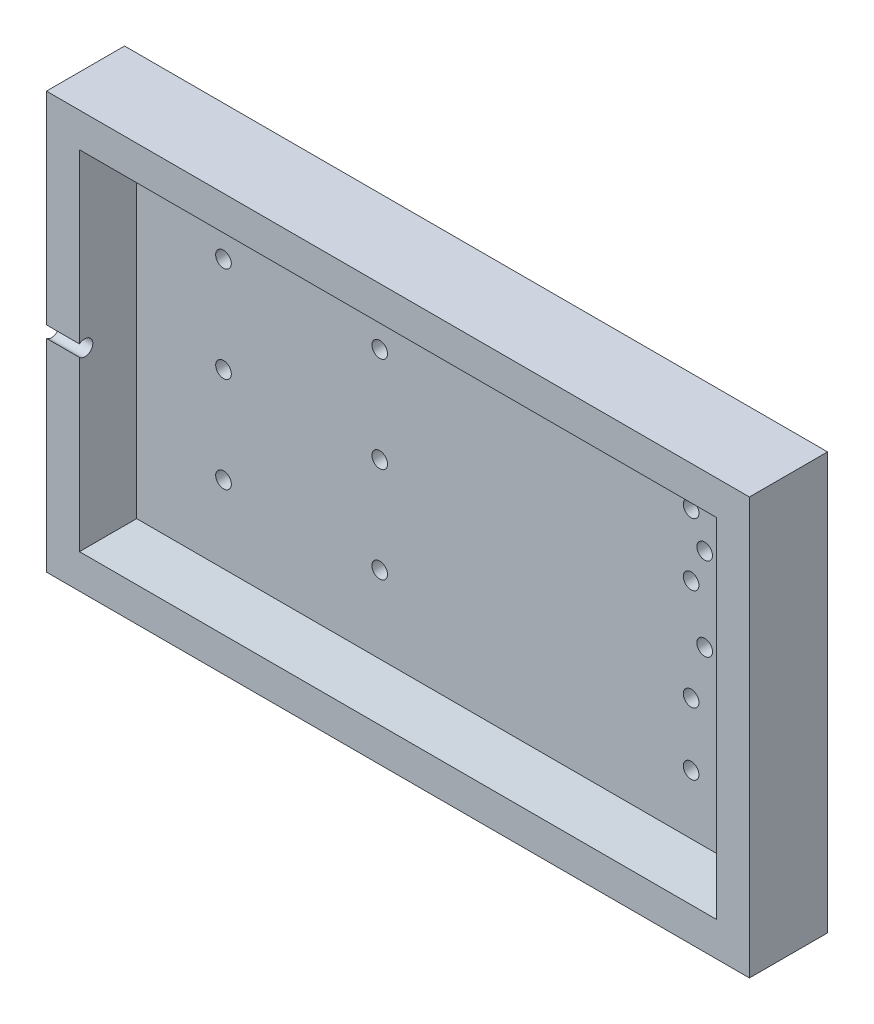
ISO-10303-21;
HEADER;
FILE_DESCRIPTION(('STEP AP214'),'2;1');
FILE_NAME('part.step','',(''),(''),'','','');
FILE_SCHEMA(('AUTOMOTIVE_DESIGN { 1 0 10303 214 1 1 1 1 }'));
ENDSEC;
DATA;
#1=APPLICATION_CONTEXT('core data for automotive mechanical design processes');
#2=APPLICATION_PROTOCOL_DEFINITION('international standard','automotive_design',2000,#1);
#3=PRODUCT_CONTEXT('',#1,'mechanical');
#4=PRODUCT('Part','Part','',(#3));
#5=PRODUCT_RELATED_PRODUCT_CATEGORY('part','',(#4));
#6=PRODUCT_DEFINITION_FORMATION('','',#4);
#7=PRODUCT_DEFINITION_CONTEXT('part definition',#1,'design');
#8=PRODUCT_DEFINITION('design','',#6,#7);
#9=PRODUCT_DEFINITION_SHAPE('','',#8);
#10=(LENGTH_UNIT() NAMED_UNIT(*) SI_UNIT(.MILLI.,.METRE.));
#11=(NAMED_UNIT(*) PLANE_ANGLE_UNIT() SI_UNIT($,.RADIAN.));
#12=(NAMED_UNIT(*) SI_UNIT($,.STERADIAN.) SOLID_ANGLE_UNIT());
#13=UNCERTAINTY_MEASURE_WITH_UNIT(LENGTH_MEASURE(1.E-05),#10,'distance_accuracy_value','');
#14=(GEOMETRIC_REPRESENTATION_CONTEXT(3) GLOBAL_UNCERTAINTY_ASSIGNED_CONTEXT((#13)) GLOBAL_UNIT_ASSIGNED_CONTEXT((#10,
#11,#12)) REPRESENTATION_CONTEXT('',''));
#15=CARTESIAN_POINT('',(0.,0.,0.));
#16=DIRECTION('',(0.,0.,1.));
#17=DIRECTION('',(1.,0.,0.));
#18=AXIS2_PLACEMENT_3D('',#15,#16,#17);
#19=CARTESIAN_POINT('',(53.3,40.,-30.));
#20=DIRECTION('',(0.,0.,-1.));
#21=DIRECTION('',(-1.,0.,0.));
#22=AXIS2_PLACEMENT_3D('',#19,#20,#21);
#23=CYLINDRICAL_SURFACE('',#22,1.5);
#24=CARTESIAN_POINT('',(53.3,40.,-40.));
#25=DIRECTION('',(0.,0.,-1.));
#26=DIRECTION('',(-1.,0.,0.));
#27=AXIS2_PLACEMENT_3D('',#24,#25,#26);
#28=CIRCLE('',#27,1.5);
#29=CARTESIAN_POINT('',(51.8,40.,-40.));
#30=VERTEX_POINT('',#29);
#31=EDGE_CURVE('E220',#30,#30,#28,.T.);
#32=ORIENTED_EDGE('',*,*,#31,.T.);
#33=EDGE_LOOP('',(#32));
#34=FACE_BOUND('',#33,.T.);
#35=CARTESIAN_POINT('',(53.3,40.,-35.7));
#36=DIRECTION('',(0.,0.,1.));
#37=DIRECTION('',(1.,0.,0.));
#38=AXIS2_PLACEMENT_3D('',#35,#36,#37);
#39=CIRCLE('',#38,1.5);
#40=CARTESIAN_POINT('',(54.8,40.,-35.7));
#41=VERTEX_POINT('',#40);
#42=EDGE_CURVE('E189',#41,#41,#39,.F.);
#43=ORIENTED_EDGE('',*,*,#42,.F.);
#44=EDGE_LOOP('',(#43));
#45=FACE_BOUND('',#44,.T.);
#46=ADVANCED_FACE('F35',(#34,#45),#23,.F.);
#47=CARTESIAN_POINT('',(113.1,49.75,-30.));
#48=DIRECTION('',(0.,0.,-1.));
#49=DIRECTION('',(-1.,0.,0.));
#50=AXIS2_PLACEMENT_3D('',#47,#48,#49);
#51=CYLINDRICAL_SURFACE('',#50,1.5);
#52=CARTESIAN_POINT('',(113.1,49.75,-40.));
#53=DIRECTION('',(0.,0.,-1.));
#54=DIRECTION('',(-1.,0.,0.));
#55=AXIS2_PLACEMENT_3D('',#52,#53,#54);
#56=CIRCLE('',#55,1.5);
#57=CARTESIAN_POINT('',(111.6,49.75,-40.));
#58=VERTEX_POINT('',#57);
#59=EDGE_CURVE('E199',#58,#58,#56,.T.);
#60=ORIENTED_EDGE('',*,*,#59,.T.);
#61=EDGE_LOOP('',(#60));
#62=FACE_BOUND('',#61,.T.);
#63=CARTESIAN_POINT('',(113.1,49.75,-35.7));
#64=DIRECTION('',(0.,0.,1.));
#65=DIRECTION('',(1.,0.,0.));
#66=AXIS2_PLACEMENT_3D('',#63,#64,#65);
#67=CIRCLE('',#66,1.5);
#68=CARTESIAN_POINT('',(114.6,49.75,-35.7));
#69=VERTEX_POINT('',#68);
#70=EDGE_CURVE('E186',#69,#69,#67,.F.);
#71=ORIENTED_EDGE('',*,*,#70,.F.);
#72=EDGE_LOOP('',(#71));
#73=FACE_BOUND('',#72,.T.);
#74=ADVANCED_FACE('F304',(#62,#73),#51,.F.);
#75=CARTESIAN_POINT('',(113.1,18.25,-30.));
#76=DIRECTION('',(0.,0.,-1.));
#77=DIRECTION('',(-1.,0.,0.));
#78=AXIS2_PLACEMENT_3D('',#75,#76,#77);
#79=CYLINDRICAL_SURFACE('',#78,1.5);
#80=CARTESIAN_POINT('',(113.1,18.25,-40.));
#81=DIRECTION('',(0.,0.,-1.));
#82=DIRECTION('',(-1.,0.,0.));
#83=AXIS2_PLACEMENT_3D('',#80,#81,#82);
#84=CIRCLE('',#83,1.5);
#85=CARTESIAN_POINT('',(111.6,18.25,-40.));
#86=VERTEX_POINT('',#85);
#87=EDGE_CURVE('E198',#86,#86,#84,.T.);
#88=ORIENTED_EDGE('',*,*,#87,.T.);
#89=EDGE_LOOP('',(#88));
#90=FACE_BOUND('',#89,.T.);
#91=CARTESIAN_POINT('',(113.1,18.25,-35.7));
#92=DIRECTION('',(0.,0.,1.));
#93=DIRECTION('',(1.,0.,0.));
#94=AXIS2_PLACEMENT_3D('',#91,#92,#93);
#95=CIRCLE('',#94,1.5);
#96=CARTESIAN_POINT('',(114.6,18.25,-35.7));
#97=VERTEX_POINT('',#96);
#98=EDGE_CURVE('E183',#97,#97,#95,.F.);
#99=ORIENTED_EDGE('',*,*,#98,.F.);
#100=EDGE_LOOP('',(#99));
#101=FACE_BOUND('',#100,.T.);
#102=ADVANCED_FACE('F310',(#90,#101),#79,.F.);
#103=CARTESIAN_POINT('',(113.1,30.25,-30.));
#104=DIRECTION('',(0.,0.,-1.));
#105=DIRECTION('',(-1.,0.,0.));
#106=AXIS2_PLACEMENT_3D('',#103,#104,#105);
#107=CYLINDRICAL_SURFACE('',#106,1.5);
#108=CARTESIAN_POINT('',(113.1,30.25,-40.));
#109=DIRECTION('',(0.,0.,-1.));
#110=DIRECTION('',(-1.,0.,0.));
#111=AXIS2_PLACEMENT_3D('',#108,#109,#110);
#112=CIRCLE('',#111,1.5);
#113=CARTESIAN_POINT('',(111.6,30.25,-40.));
#114=VERTEX_POINT('',#113);
#115=EDGE_CURVE('E195',#114,#114,#112,.T.);
#116=ORIENTED_EDGE('',*,*,#115,.T.);
#117=EDGE_LOOP('',(#116));
#118=FACE_BOUND('',#117,.T.);
#119=CARTESIAN_POINT('',(113.1,30.25,-35.7));
#120=DIRECTION('',(0.,0.,1.));
#121=DIRECTION('',(1.,0.,0.));
#122=AXIS2_PLACEMENT_3D('',#119,#120,#121);
#123=CIRCLE('',#122,1.5);
#124=CARTESIAN_POINT('',(114.6,30.25,-35.7));
#125=VERTEX_POINT('',#124);
#126=EDGE_CURVE('E180',#125,#125,#123,.F.);
#127=ORIENTED_EDGE('',*,*,#126,.F.);
#128=EDGE_LOOP('',(#127));
#129=FACE_BOUND('',#128,.T.);
#130=ADVANCED_FACE('F421',(#118,#129),#107,.F.);
#131=CARTESIAN_POINT('',(53.3,58.35,-30.));
#132=DIRECTION('',(0.,0.,-1.));
#133=DIRECTION('',(-1.,0.,0.));
#134=AXIS2_PLACEMENT_3D('',#131,#132,#133);
#135=CYLINDRICAL_SURFACE('',#134,1.5);
#136=CARTESIAN_POINT('',(53.3,58.35,-40.));
#137=DIRECTION('',(0.,0.,-1.));
#138=DIRECTION('',(-1.,0.,0.));
#139=AXIS2_PLACEMENT_3D('',#136,#137,#138);
#140=CIRCLE('',#139,1.5);
#141=CARTESIAN_POINT('',(51.8,58.35,-40.));
#142=VERTEX_POINT('',#141);
#143=EDGE_CURVE('E217',#142,#142,#140,.T.);
#144=ORIENTED_EDGE('',*,*,#143,.T.);
#145=EDGE_LOOP('',(#144));
#146=FACE_BOUND('',#145,.T.);
#147=CARTESIAN_POINT('',(53.3,58.35,-35.7));
#148=DIRECTION('',(0.,0.,1.));
#149=DIRECTION('',(1.,0.,0.));
#150=AXIS2_PLACEMENT_3D('',#147,#148,#149);
#151=CIRCLE('',#150,1.5);
#152=CARTESIAN_POINT('',(54.8,58.35,-35.7));
#153=VERTEX_POINT('',#152);
#154=EDGE_CURVE('E177',#153,#153,#151,.F.);
#155=ORIENTED_EDGE('',*,*,#154,.F.);
#156=EDGE_LOOP('',(#155));
#157=FACE_BOUND('',#156,.T.);
#158=ADVANCED_FACE('F411',(#146,#157),#135,.F.);
#159=CARTESIAN_POINT('',(53.3,21.65,-30.));
#160=DIRECTION('',(0.,0.,-1.));
#161=DIRECTION('',(-1.,0.,0.));
#162=AXIS2_PLACEMENT_3D('',#159,#160,#161);
#163=CYLINDRICAL_SURFACE('',#162,1.5);
#164=CARTESIAN_POINT('',(53.3,21.65,-40.));
#165=DIRECTION('',(0.,0.,-1.));
#166=DIRECTION('',(-1.,0.,0.));
#167=AXIS2_PLACEMENT_3D('',#164,#165,#166);
#168=CIRCLE('',#167,1.5);
#169=CARTESIAN_POINT('',(51.8,21.65,-40.));
#170=VERTEX_POINT('',#169);
#171=EDGE_CURVE('E221',#170,#170,#168,.T.);
#172=ORIENTED_EDGE('',*,*,#171,.T.);
#173=EDGE_LOOP('',(#172));
#174=FACE_BOUND('',#173,.T.);
#175=CARTESIAN_POINT('',(53.3,21.65,-35.7));
#176=DIRECTION('',(0.,0.,1.));
#177=DIRECTION('',(1.,0.,0.));
#178=AXIS2_PLACEMENT_3D('',#175,#176,#177);
#179=CIRCLE('',#178,1.5);
#180=CARTESIAN_POINT('',(54.8,21.65,-35.7));
#181=VERTEX_POINT('',#180);
#182=EDGE_CURVE('E174',#181,#181,#179,.F.);
#183=ORIENTED_EDGE('',*,*,#182,.F.);
#184=EDGE_LOOP('',(#183));
#185=FACE_BOUND('',#184,.T.);
#186=ADVANCED_FACE('F402',(#174,#185),#163,.F.);
#187=CARTESIAN_POINT('',(23.3,58.35,-30.));
#188=DIRECTION('',(0.,0.,-1.));
#189=DIRECTION('',(-1.,0.,0.));
#190=AXIS2_PLACEMENT_3D('',#187,#188,#189);
#191=CYLINDRICAL_SURFACE('',#190,1.5);
#192=CARTESIAN_POINT('',(23.3,58.35,-40.));
#193=DIRECTION('',(0.,0.,-1.));
#194=DIRECTION('',(-1.,0.,0.));
#195=AXIS2_PLACEMENT_3D('',#192,#193,#194);
#196=CIRCLE('',#195,1.5);
#197=CARTESIAN_POINT('',(21.8,58.35,-40.));
#198=VERTEX_POINT('',#197);
#199=EDGE_CURVE('E224',#198,#198,#196,.T.);
#200=ORIENTED_EDGE('',*,*,#199,.T.);
#201=EDGE_LOOP('',(#200));
#202=FACE_BOUND('',#201,.T.);
#203=CARTESIAN_POINT('',(23.3,58.35,-35.7));
#204=DIRECTION('',(0.,0.,1.));
#205=DIRECTION('',(1.,0.,0.));
#206=AXIS2_PLACEMENT_3D('',#203,#204,#205);
#207=CIRCLE('',#206,1.5);
#208=CARTESIAN_POINT('',(24.8,58.35,-35.7));
#209=VERTEX_POINT('',#208);
#210=EDGE_CURVE('E171',#209,#209,#207,.F.);
#211=ORIENTED_EDGE('',*,*,#210,.F.);
#212=EDGE_LOOP('',(#211));
#213=FACE_BOUND('',#212,.T.);
#214=ADVANCED_FACE('F393',(#202,#213),#191,.F.);
#215=CARTESIAN_POINT('',(23.3,40.,-30.));
#216=DIRECTION('',(0.,0.,-1.));
#217=DIRECTION('',(-1.,0.,0.));
#218=AXIS2_PLACEMENT_3D('',#215,#216,#217);
#219=CYLINDRICAL_SURFACE('',#218,1.5);
#220=CARTESIAN_POINT('',(23.3,40.,-40.));
#221=DIRECTION('',(0.,0.,-1.));
#222=DIRECTION('',(-1.,0.,0.));
#223=AXIS2_PLACEMENT_3D('',#220,#221,#222);
#224=CIRCLE('',#223,1.5);
#225=CARTESIAN_POINT('',(21.8,40.,-40.));
#226=VERTEX_POINT('',#225);
#227=EDGE_CURVE('E208',#226,#226,#224,.T.);
#228=ORIENTED_EDGE('',*,*,#227,.T.);
#229=EDGE_LOOP('',(#228));
#230=FACE_BOUND('',#229,.T.);
#231=CARTESIAN_POINT('',(23.3,40.,-35.7));
#232=DIRECTION('',(0.,0.,1.));
#233=DIRECTION('',(1.,0.,0.));
#234=AXIS2_PLACEMENT_3D('',#231,#232,#233);
#235=CIRCLE('',#234,1.5);
#236=CARTESIAN_POINT('',(24.8,40.,-35.7));
#237=VERTEX_POINT('',#236);
#238=EDGE_CURVE('E168',#237,#237,#235,.F.);
#239=ORIENTED_EDGE('',*,*,#238,.F.);
#240=EDGE_LOOP('',(#239));
#241=FACE_BOUND('',#240,.T.);
#242=ADVANCED_FACE('F315',(#230,#241),#219,.F.);
#243=CARTESIAN_POINT('',(23.3,21.65,-30.));
#244=DIRECTION('',(0.,0.,-1.));
#245=DIRECTION('',(-1.,0.,0.));
#246=AXIS2_PLACEMENT_3D('',#243,#244,#245);
#247=CYLINDRICAL_SURFACE('',#246,1.5);
#248=CARTESIAN_POINT('',(23.3,21.65,-40.));
#249=DIRECTION('',(0.,0.,-1.));
#250=DIRECTION('',(-1.,0.,0.));
#251=AXIS2_PLACEMENT_3D('',#248,#249,#250);
#252=CIRCLE('',#251,1.5);
#253=CARTESIAN_POINT('',(21.8,21.65,-40.));
#254=VERTEX_POINT('',#253);
#255=EDGE_CURVE('E205',#254,#254,#252,.T.);
#256=ORIENTED_EDGE('',*,*,#255,.T.);
#257=EDGE_LOOP('',(#256));
#258=FACE_BOUND('',#257,.T.);
#259=CARTESIAN_POINT('',(23.3,21.65,-35.7));
#260=DIRECTION('',(0.,0.,1.));
#261=DIRECTION('',(1.,0.,0.));
#262=AXIS2_PLACEMENT_3D('',#259,#260,#261);
#263=CIRCLE('',#262,1.5);
#264=CARTESIAN_POINT('',(24.8,21.65,-35.7));
#265=VERTEX_POINT('',#264);
#266=EDGE_CURVE('E165',#265,#265,#263,.F.);
#267=ORIENTED_EDGE('',*,*,#266,.F.);
#268=EDGE_LOOP('',(#267));
#269=FACE_BOUND('',#268,.T.);
#270=ADVANCED_FACE('F374',(#258,#269),#247,.F.);
#271=CARTESIAN_POINT('',(115.7,40.,-30.));
#272=DIRECTION('',(0.,0.,-1.));
#273=DIRECTION('',(-1.,0.,0.));
#274=AXIS2_PLACEMENT_3D('',#271,#272,#273);
#275=CYLINDRICAL_SURFACE('',#274,1.5);
#276=CARTESIAN_POINT('',(115.7,40.,-40.));
#277=DIRECTION('',(0.,0.,-1.));
#278=DIRECTION('',(-1.,0.,0.));
#279=AXIS2_PLACEMENT_3D('',#276,#277,#278);
#280=CIRCLE('',#279,1.5);
#281=CARTESIAN_POINT('',(114.2,40.,-40.));
#282=VERTEX_POINT('',#281);
#283=EDGE_CURVE('E209',#282,#282,#280,.T.);
#284=ORIENTED_EDGE('',*,*,#283,.T.);
#285=EDGE_LOOP('',(#284));
#286=FACE_BOUND('',#285,.T.);
#287=CARTESIAN_POINT('',(115.7,40.,-35.7));
#288=DIRECTION('',(0.,0.,1.));
#289=DIRECTION('',(1.,0.,0.));
#290=AXIS2_PLACEMENT_3D('',#287,#288,#289);
#291=CIRCLE('',#290,1.5);
#292=CARTESIAN_POINT('',(117.2,40.,-35.7));
#293=VERTEX_POINT('',#292);
#294=EDGE_CURVE('E147',#293,#293,#291,.F.);
#295=ORIENTED_EDGE('',*,*,#294,.F.);
#296=EDGE_LOOP('',(#295));
#297=FACE_BOUND('',#296,.T.);
#298=ADVANCED_FACE('F364',(#286,#297),#275,.F.);
#299=CARTESIAN_POINT('',(115.7,56.,-30.));
#300=DIRECTION('',(0.,0.,-1.));
#301=DIRECTION('',(-1.,0.,0.));
#302=AXIS2_PLACEMENT_3D('',#299,#300,#301);
#303=CYLINDRICAL_SURFACE('',#302,1.5);
#304=CARTESIAN_POINT('',(115.7,56.,-40.));
#305=DIRECTION('',(0.,0.,-1.));
#306=DIRECTION('',(-1.,0.,0.));
#307=AXIS2_PLACEMENT_3D('',#304,#305,#306);
#308=CIRCLE('',#307,1.5);
#309=CARTESIAN_POINT('',(114.2,56.,-40.));
#310=VERTEX_POINT('',#309);
#311=EDGE_CURVE('E212',#310,#310,#308,.T.);
#312=ORIENTED_EDGE('',*,*,#311,.T.);
#313=EDGE_LOOP('',(#312));
#314=FACE_BOUND('',#313,.T.);
#315=CARTESIAN_POINT('',(115.7,56.,-35.7));
#316=DIRECTION('',(0.,0.,1.));
#317=DIRECTION('',(1.,0.,0.));
#318=AXIS2_PLACEMENT_3D('',#315,#316,#317);
#319=CIRCLE('',#318,1.5);
#320=CARTESIAN_POINT('',(117.2,56.,-35.7));
#321=VERTEX_POINT('',#320);
#322=EDGE_CURVE('E142',#321,#321,#319,.F.);
#323=ORIENTED_EDGE('',*,*,#322,.F.);
#324=EDGE_LOOP('',(#323));
#325=FACE_BOUND('',#324,.T.);
#326=ADVANCED_FACE('F353',(#314,#325),#303,.F.);
#327=CARTESIAN_POINT('',(113.1,61.75,-30.));
#328=DIRECTION('',(0.,0.,-1.));
#329=DIRECTION('',(-1.,0.,0.));
#330=AXIS2_PLACEMENT_3D('',#327,#328,#329);
#331=CYLINDRICAL_SURFACE('',#330,1.5);
#332=CARTESIAN_POINT('',(113.1,61.75,-40.));
#333=DIRECTION('',(0.,0.,-1.));
#334=DIRECTION('',(-1.,0.,0.));
#335=AXIS2_PLACEMENT_3D('',#332,#333,#334);
#336=CIRCLE('',#335,1.5);
#337=CARTESIAN_POINT('',(111.6,61.75,-40.));
#338=VERTEX_POINT('',#337);
#339=EDGE_CURVE('E202',#338,#338,#336,.T.);
#340=ORIENTED_EDGE('',*,*,#339,.T.);
#341=EDGE_LOOP('',(#340));
#342=FACE_BOUND('',#341,.T.);
#343=CARTESIAN_POINT('',(113.1,61.75,-35.7));
#344=DIRECTION('',(0.,0.,1.));
#345=DIRECTION('',(1.,0.,0.));
#346=AXIS2_PLACEMENT_3D('',#343,#344,#345);
#347=CIRCLE('',#346,1.5);
#348=CARTESIAN_POINT('',(114.6,61.75,-35.7));
#349=VERTEX_POINT('',#348);
#350=EDGE_CURVE('E140',#349,#349,#347,.F.);
#351=ORIENTED_EDGE('',*,*,#350,.F.);
#352=EDGE_LOOP('',(#351));
#353=FACE_BOUND('',#352,.T.);
#354=ADVANCED_FACE('F337',(#342,#353),#331,.F.);
#355=CARTESIAN_POINT('',(0.,0.,-40.));
#356=DIRECTION('',(-1.,0.,0.));
#357=DIRECTION('',(0.,0.,1.));
#358=AXIS2_PLACEMENT_3D('',#355,#356,#357);
#359=PLANE('',#358);
#360=DIRECTION('',(0.,1.,0.));
#361=VECTOR('',#360,1.);
#362=CARTESIAN_POINT('',(0.,-20.,-25.));
#363=LINE('',#362,#361);
#364=CARTESIAN_POINT('',(0.,41.1180339887499,-25.));
#365=VERTEX_POINT('',#364);
#366=CARTESIAN_POINT('',(0.,80.,-25.));
#367=VERTEX_POINT('',#366);
#368=EDGE_CURVE('E119',#365,#367,#363,.T.);
#369=ORIENTED_EDGE('',*,*,#368,.T.);
#370=DIRECTION('',(0.,0.,1.));
#371=VECTOR('',#370,1.);
#372=CARTESIAN_POINT('',(0.,80.,-40.));
#373=LINE('',#372,#371);
#374=CARTESIAN_POINT('',(0.,80.,-40.));
#375=VERTEX_POINT('',#374);
#376=EDGE_CURVE('E43',#375,#367,#373,.T.);
#377=ORIENTED_EDGE('',*,*,#376,.F.);
#378=DIRECTION('',(0.,-1.,0.));
#379=VECTOR('',#378,1.);
#380=CARTESIAN_POINT('',(0.,0.,-40.));
#381=LINE('',#380,#379);
#382=CARTESIAN_POINT('',(0.,0.,-40.));
#383=VERTEX_POINT('',#382);
#384=EDGE_CURVE('E231',#375,#383,#381,.T.);
#385=ORIENTED_EDGE('',*,*,#384,.T.);
#386=DIRECTION('',(0.,0.,1.));
#387=VECTOR('',#386,1.);
#388=CARTESIAN_POINT('',(0.,0.,-40.));
#389=LINE('',#388,#387);
#390=CARTESIAN_POINT('',(0.,0.,-25.));
#391=VERTEX_POINT('',#390);
#392=EDGE_CURVE('E134',#383,#391,#389,.T.);
#393=ORIENTED_EDGE('',*,*,#392,.T.);
#394=CARTESIAN_POINT('',(0.,38.8819660112501,-25.));
#395=VERTEX_POINT('',#394);
#396=EDGE_CURVE('E241',#391,#395,#363,.T.);
#397=ORIENTED_EDGE('',*,*,#396,.T.);
#398=CARTESIAN_POINT('',(0.,40.,-26.));
#399=DIRECTION('',(-1.,0.,0.));
#400=DIRECTION('',(0.,0.,1.));
#401=AXIS2_PLACEMENT_3D('',#398,#399,#400);
#402=CIRCLE('',#401,1.5);
#403=EDGE_CURVE('E192',#365,#395,#402,.T.);
#404=ORIENTED_EDGE('',*,*,#403,.F.);
#405=EDGE_LOOP('',(#369,#377,#385,#393,#397,#404));
#406=FACE_BOUND('',#405,.T.);
#407=ADVANCED_FACE('F37',(#406),#359,.T.);
#408=CARTESIAN_POINT('',(0.,80.,-40.));
#409=DIRECTION('',(0.,1.,0.));
#410=DIRECTION('',(0.,0.,1.));
#411=AXIS2_PLACEMENT_3D('',#408,#409,#410);
#412=PLANE('',#411);
#413=DIRECTION('',(-1.,0.,0.));
#414=VECTOR('',#413,1.);
#415=CARTESIAN_POINT('',(0.,80.,-25.));
#416=LINE('',#415,#414);
#417=CARTESIAN_POINT('',(135.,80.,-25.));
#418=VERTEX_POINT('',#417);
#419=EDGE_CURVE('E113',#418,#367,#416,.T.);
#420=ORIENTED_EDGE('',*,*,#419,.F.);
#421=DIRECTION('',(0.,0.,1.));
#422=VECTOR('',#421,1.);
#423=CARTESIAN_POINT('',(135.,80.,-40.));
#424=LINE('',#423,#422);
#425=CARTESIAN_POINT('',(135.,80.,-40.));
#426=VERTEX_POINT('',#425);
#427=EDGE_CURVE('E124',#426,#418,#424,.T.);
#428=ORIENTED_EDGE('',*,*,#427,.F.);
#429=DIRECTION('',(-1.,0.,0.));
#430=VECTOR('',#429,1.);
#431=CARTESIAN_POINT('',(0.,80.,-40.));
#432=LINE('',#431,#430);
#433=EDGE_CURVE('E139',#426,#375,#432,.T.);
#434=ORIENTED_EDGE('',*,*,#433,.T.);
#435=ORIENTED_EDGE('',*,*,#376,.T.);
#436=EDGE_LOOP('',(#420,#428,#434,#435));
#437=FACE_BOUND('',#436,.T.);
#438=ADVANCED_FACE('F122',(#437),#412,.T.);
#439=CARTESIAN_POINT('',(135.,0.,-40.));
#440=DIRECTION('',(1.,0.,0.));
#441=DIRECTION('',(0.,0.,-1.));
#442=AXIS2_PLACEMENT_3D('',#439,#440,#441);
#443=PLANE('',#442);
#444=DIRECTION('',(0.,1.,0.));
#445=VECTOR('',#444,1.);
#446=CARTESIAN_POINT('',(135.,-20.,-25.));
#447=LINE('',#446,#445);
#448=CARTESIAN_POINT('',(135.,0.,-25.));
#449=VERTEX_POINT('',#448);
#450=EDGE_CURVE('E110',#449,#418,#447,.T.);
#451=ORIENTED_EDGE('',*,*,#450,.F.);
#452=DIRECTION('',(0.,0.,1.));
#453=VECTOR('',#452,1.);
#454=CARTESIAN_POINT('',(135.,0.,-40.));
#455=LINE('',#454,#453);
#456=CARTESIAN_POINT('',(135.,0.,-40.));
#457=VERTEX_POINT('',#456);
#458=EDGE_CURVE('E131',#457,#449,#455,.T.);
#459=ORIENTED_EDGE('',*,*,#458,.F.);
#460=DIRECTION('',(0.,1.,0.));
#461=VECTOR('',#460,1.);
#462=CARTESIAN_POINT('',(135.,0.,-40.));
#463=LINE('',#462,#461);
#464=EDGE_CURVE('E129',#457,#426,#463,.T.);
#465=ORIENTED_EDGE('',*,*,#464,.T.);
#466=ORIENTED_EDGE('',*,*,#427,.T.);
#467=EDGE_LOOP('',(#451,#459,#465,#466));
#468=FACE_BOUND('',#467,.T.);
#469=ADVANCED_FACE('F127',(#468),#443,.T.);
#470=CARTESIAN_POINT('',(0.,0.,-40.));
#471=DIRECTION('',(0.,-1.,0.));
#472=DIRECTION('',(0.,0.,-1.));
#473=AXIS2_PLACEMENT_3D('',#470,#471,#472);
#474=PLANE('',#473);
#475=DIRECTION('',(1.,0.,0.));
#476=VECTOR('',#475,1.);
#477=CARTESIAN_POINT('',(0.,0.,-25.));
#478=LINE('',#477,#476);
#479=EDGE_CURVE('E115',#391,#449,#478,.T.);
#480=ORIENTED_EDGE('',*,*,#479,.F.);
#481=ORIENTED_EDGE('',*,*,#392,.F.);
#482=DIRECTION('',(1.,0.,0.));
#483=VECTOR('',#482,1.);
#484=CARTESIAN_POINT('',(0.,0.,-40.));
#485=LINE('',#484,#483);
#486=EDGE_CURVE('E233',#383,#457,#485,.T.);
#487=ORIENTED_EDGE('',*,*,#486,.T.);
#488=ORIENTED_EDGE('',*,*,#458,.T.);
#489=EDGE_LOOP('',(#480,#481,#487,#488));
#490=FACE_BOUND('',#489,.T.);
#491=ADVANCED_FACE('F243',(#490),#474,.T.);
#492=CARTESIAN_POINT('',(0.,0.,-40.));
#493=DIRECTION('',(0.,0.,-1.));
#494=DIRECTION('',(-1.,0.,0.));
#495=AXIS2_PLACEMENT_3D('',#492,#493,#494);
#496=PLANE('',#495);
#497=ORIENTED_EDGE('',*,*,#339,.F.);
#498=EDGE_LOOP('',(#497));
#499=FACE_BOUND('',#498,.T.);
#500=ORIENTED_EDGE('',*,*,#311,.F.);
#501=EDGE_LOOP('',(#500));
#502=FACE_BOUND('',#501,.T.);
#503=ORIENTED_EDGE('',*,*,#283,.F.);
#504=EDGE_LOOP('',(#503));
#505=FACE_BOUND('',#504,.T.);
#506=ORIENTED_EDGE('',*,*,#255,.F.);
#507=EDGE_LOOP('',(#506));
#508=FACE_BOUND('',#507,.T.);
#509=ORIENTED_EDGE('',*,*,#227,.F.);
#510=EDGE_LOOP('',(#509));
#511=FACE_BOUND('',#510,.T.);
#512=ORIENTED_EDGE('',*,*,#199,.F.);
#513=EDGE_LOOP('',(#512));
#514=FACE_BOUND('',#513,.T.);
#515=ORIENTED_EDGE('',*,*,#171,.F.);
#516=EDGE_LOOP('',(#515));
#517=FACE_BOUND('',#516,.T.);
#518=ORIENTED_EDGE('',*,*,#143,.F.);
#519=EDGE_LOOP('',(#518));
#520=FACE_BOUND('',#519,.T.);
#521=ORIENTED_EDGE('',*,*,#115,.F.);
#522=EDGE_LOOP('',(#521));
#523=FACE_BOUND('',#522,.T.);
#524=ORIENTED_EDGE('',*,*,#87,.F.);
#525=EDGE_LOOP('',(#524));
#526=FACE_BOUND('',#525,.T.);
#527=ORIENTED_EDGE('',*,*,#59,.F.);
#528=EDGE_LOOP('',(#527));
#529=FACE_BOUND('',#528,.T.);
#530=ORIENTED_EDGE('',*,*,#31,.F.);
#531=EDGE_LOOP('',(#530));
#532=FACE_BOUND('',#531,.T.);
#533=ORIENTED_EDGE('',*,*,#384,.F.);
#534=ORIENTED_EDGE('',*,*,#433,.F.);
#535=ORIENTED_EDGE('',*,*,#464,.F.);
#536=ORIENTED_EDGE('',*,*,#486,.F.);
#537=EDGE_LOOP('',(#533,#534,#535,#536));
#538=FACE_BOUND('',#537,.T.);
#539=ADVANCED_FACE('F237',(#499,#502,#505,#508,#511,#514,#517,#520,#523,#526,#529,#532,#538),
#496,.T.);
#540=CARTESIAN_POINT('',(10.,40.,-26.));
#541=DIRECTION('',(-1.,0.,0.));
#542=DIRECTION('',(0.,0.,1.));
#543=AXIS2_PLACEMENT_3D('',#540,#541,#542);
#544=CYLINDRICAL_SURFACE('',#543,1.5);
#545=ORIENTED_EDGE('',*,*,#403,.T.);
#546=DIRECTION('',(-1.,0.,0.));
#547=VECTOR('',#546,1.);
#548=CARTESIAN_POINT('',(10.,38.8819660112501,-25.));
#549=LINE('',#548,#547);
#550=CARTESIAN_POINT('',(6.34264803922962,38.8819660112501,-25.));
#551=VERTEX_POINT('',#550);
#552=EDGE_CURVE('E245',#395,#551,#549,.F.);
#553=ORIENTED_EDGE('',*,*,#552,.T.);
#554=CARTESIAN_POINT('',(6.3688339607988,40.,-26.));
#555=DIRECTION('',(-0.999657324975557,0.,-0.0261769483078695));
#556=DIRECTION('',(-0.0261769483078695,0.,0.999657324975557));
#557=AXIS2_PLACEMENT_3D('',#554,#555,#556);
#558=ELLIPSE('',#557,1.5005141887363,1.5);
#559=CARTESIAN_POINT('',(6.34264803922962,41.1180339887499,-25.));
#560=VERTEX_POINT('',#559);
#561=EDGE_CURVE('E143',#551,#560,#558,.F.);
#562=ORIENTED_EDGE('',*,*,#561,.T.);
#563=DIRECTION('',(-1.,0.,0.));
#564=VECTOR('',#563,1.);
#565=CARTESIAN_POINT('',(10.,41.1180339887499,-25.));
#566=LINE('',#565,#564);
#567=EDGE_CURVE('E286',#560,#365,#566,.T.);
#568=ORIENTED_EDGE('',*,*,#567,.T.);
#569=EDGE_LOOP('',(#545,#553,#562,#568));
#570=FACE_BOUND('',#569,.T.);
#571=ADVANCED_FACE('F290',(#570),#544,.F.);
#572=CARTESIAN_POINT('',(67.5,40.,-35.7));
#573=DIRECTION('',(0.,0.,1.));
#574=DIRECTION('',(1.,0.,0.));
#575=AXIS2_PLACEMENT_3D('',#572,#573,#574);
#576=PLANE('',#575);
#577=DIRECTION('',(0.,1.,0.));
#578=VECTOR('',#577,1.);
#579=CARTESIAN_POINT('',(128.37716259998,40.,-35.7));
#580=LINE('',#579,#578);
#581=CARTESIAN_POINT('',(128.37716259998,6.85816993629444,-35.7));
#582=VERTEX_POINT('',#581);
#583=CARTESIAN_POINT('',(128.37716259998,73.1418300637055,-35.7));
#584=VERTEX_POINT('',#583);
#585=EDGE_CURVE('E244',#582,#584,#580,.T.);
#586=ORIENTED_EDGE('',*,*,#585,.T.);
#587=DIRECTION('',(-1.,0.,0.));
#588=VECTOR('',#587,1.);
#589=CARTESIAN_POINT('',(67.5,73.1418300637055,-35.7));
#590=LINE('',#589,#588);
#591=CARTESIAN_POINT('',(6.62283740001987,73.1418300637055,-35.7));
#592=VERTEX_POINT('',#591);
#593=EDGE_CURVE('E160',#584,#592,#590,.T.);
#594=ORIENTED_EDGE('',*,*,#593,.T.);
#595=DIRECTION('',(0.,-1.,0.));
#596=VECTOR('',#595,1.);
#597=CARTESIAN_POINT('',(6.62283740001988,40.,-35.7));
#598=LINE('',#597,#596);
#599=CARTESIAN_POINT('',(6.62283740001988,6.85816993629444,-35.7));
#600=VERTEX_POINT('',#599);
#601=EDGE_CURVE('E262',#592,#600,#598,.T.);
#602=ORIENTED_EDGE('',*,*,#601,.T.);
#603=DIRECTION('',(1.,0.,0.));
#604=VECTOR('',#603,1.);
#605=CARTESIAN_POINT('',(67.5,6.85816993629444,-35.7));
#606=LINE('',#605,#604);
#607=EDGE_CURVE('E257',#600,#582,#606,.T.);
#608=ORIENTED_EDGE('',*,*,#607,.T.);
#609=EDGE_LOOP('',(#586,#594,#602,#608));
#610=FACE_BOUND('',#609,.T.);
#611=ORIENTED_EDGE('',*,*,#350,.T.);
#612=EDGE_LOOP('',(#611));
#613=FACE_BOUND('',#612,.T.);
#614=ORIENTED_EDGE('',*,*,#322,.T.);
#615=EDGE_LOOP('',(#614));
#616=FACE_BOUND('',#615,.T.);
#617=ORIENTED_EDGE('',*,*,#294,.T.);
#618=EDGE_LOOP('',(#617));
#619=FACE_BOUND('',#618,.T.);
#620=ORIENTED_EDGE('',*,*,#266,.T.);
#621=EDGE_LOOP('',(#620));
#622=FACE_BOUND('',#621,.T.);
#623=ORIENTED_EDGE('',*,*,#238,.T.);
#624=EDGE_LOOP('',(#623));
#625=FACE_BOUND('',#624,.T.);
#626=ORIENTED_EDGE('',*,*,#210,.T.);
#627=EDGE_LOOP('',(#626));
#628=FACE_BOUND('',#627,.T.);
#629=ORIENTED_EDGE('',*,*,#182,.T.);
#630=EDGE_LOOP('',(#629));
#631=FACE_BOUND('',#630,.T.);
#632=ORIENTED_EDGE('',*,*,#154,.T.);
#633=EDGE_LOOP('',(#632));
#634=FACE_BOUND('',#633,.T.);
#635=ORIENTED_EDGE('',*,*,#126,.T.);
#636=EDGE_LOOP('',(#635));
#637=FACE_BOUND('',#636,.T.);
#638=ORIENTED_EDGE('',*,*,#98,.T.);
#639=EDGE_LOOP('',(#638));
#640=FACE_BOUND('',#639,.T.);
#641=ORIENTED_EDGE('',*,*,#70,.T.);
#642=EDGE_LOOP('',(#641));
#643=FACE_BOUND('',#642,.T.);
#644=ORIENTED_EDGE('',*,*,#42,.T.);
#645=EDGE_LOOP('',(#644));
#646=FACE_BOUND('',#645,.T.);
#647=ADVANCED_FACE('F270',(#610,#613,#616,#619,#622,#625,#628,#631,#634,#637,#640,#643,#646),
#576,.T.);
#648=CARTESIAN_POINT('',(5.68800000000003,74.08125,0.));
#649=DIRECTION('',(-0.999657324975557,0.,-0.0261769483078695));
#650=DIRECTION('',(-0.0261769483078695,0.,0.999657324975557));
#651=AXIS2_PLACEMENT_3D('',#648,#649,#650);
#652=PLANE('',#651);
#653=DIRECTION('',(-0.0261678962124951,0.0262961702135367,0.999311639399798));
#654=VECTOR('',#653,1.);
#655=CARTESIAN_POINT('',(5.77265319062246,73.9961818427569,-3.23277492444828));
#656=LINE('',#655,#654);
#657=CARTESIAN_POINT('',(6.34264803922961,73.4233929017546,-25.));
#658=VERTEX_POINT('',#657);
#659=EDGE_CURVE('E256',#592,#658,#656,.T.);
#660=ORIENTED_EDGE('',*,*,#659,.T.);
#661=DIRECTION('',(0.,-1.,0.));
#662=VECTOR('',#661,1.);
#663=CARTESIAN_POINT('',(6.34264803922961,74.08125,-25.));
#664=LINE('',#663,#662);
#665=EDGE_CURVE('E50',#658,#560,#664,.T.);
#666=ORIENTED_EDGE('',*,*,#665,.T.);
#667=ORIENTED_EDGE('',*,*,#561,.F.);
#668=CARTESIAN_POINT('',(6.34264803922962,6.57660709824541,-25.));
#669=VERTEX_POINT('',#668);
#670=EDGE_CURVE('E249',#551,#669,#664,.T.);
#671=ORIENTED_EDGE('',*,*,#670,.T.);
#672=DIRECTION('',(-0.0261678962124951,-0.0262961702135367,0.999311639399798));
#673=VECTOR('',#672,1.);
#674=CARTESIAN_POINT('',(5.73444750145541,5.96542518528603,-1.77375851877731));
#675=LINE('',#674,#673);
#676=EDGE_CURVE('E157',#600,#669,#675,.T.);
#677=ORIENTED_EDGE('',*,*,#676,.F.);
#678=ORIENTED_EDGE('',*,*,#601,.F.);
#679=EDGE_LOOP('',(#660,#666,#667,#671,#677,#678));
#680=FACE_BOUND('',#679,.T.);
#681=ADVANCED_FACE('F275',(#680),#652,.F.);
#682=CARTESIAN_POINT('',(129.312,5.91874999999999,0.));
#683=DIRECTION('',(0.999657324975557,0.,-0.0261769483078695));
#684=DIRECTION('',(-0.0261769483078695,0.,-0.999657324975557));
#685=AXIS2_PLACEMENT_3D('',#682,#683,#684);
#686=PLANE('',#685);
#687=DIRECTION('',(0.0261678962124951,-0.0262961702135367,0.999311639399798));
#688=VECTOR('',#687,1.);
#689=CARTESIAN_POINT('',(129.227346809378,6.00381815724312,-3.23277492444828));
#690=LINE('',#689,#688);
#691=CARTESIAN_POINT('',(128.65735196077,6.57660709824541,-25.));
#692=VERTEX_POINT('',#691);
#693=EDGE_CURVE('E150',#582,#692,#690,.T.);
#694=ORIENTED_EDGE('',*,*,#693,.T.);
#695=DIRECTION('',(0.,1.,0.));
#696=VECTOR('',#695,1.);
#697=CARTESIAN_POINT('',(128.65735196077,5.91874999999999,-25.));
#698=LINE('',#697,#696);
#699=CARTESIAN_POINT('',(128.65735196077,73.4233929017546,-25.));
#700=VERTEX_POINT('',#699);
#701=EDGE_CURVE('E284',#692,#700,#698,.T.);
#702=ORIENTED_EDGE('',*,*,#701,.T.);
#703=DIRECTION('',(0.0261678962124951,0.0262961702135368,0.999311639399798));
#704=VECTOR('',#703,1.);
#705=CARTESIAN_POINT('',(129.265552498545,74.0345748147139,-1.77375851877731));
#706=LINE('',#705,#704);
#707=EDGE_CURVE('E253',#584,#700,#706,.T.);
#708=ORIENTED_EDGE('',*,*,#707,.F.);
#709=ORIENTED_EDGE('',*,*,#585,.F.);
#710=EDGE_LOOP('',(#694,#702,#708,#709));
#711=FACE_BOUND('',#710,.T.);
#712=ADVANCED_FACE('F283',(#711),#686,.F.);
#713=CARTESIAN_POINT('',(5.68800000000004,5.91874999999999,0.));
#714=DIRECTION('',(0.,-0.999653958930172,-0.0263051781068537));
#715=DIRECTION('',(0.,0.0263051781068537,-0.999653958930172));
#716=AXIS2_PLACEMENT_3D('',#713,#714,#715);
#717=PLANE('',#716);
#718=ORIENTED_EDGE('',*,*,#676,.T.);
#719=DIRECTION('',(1.,0.,0.));
#720=VECTOR('',#719,1.);
#721=CARTESIAN_POINT('',(5.68800000000004,6.5766070982454,-25.));
#722=LINE('',#721,#720);
#723=EDGE_CURVE('E280',#669,#692,#722,.T.);
#724=ORIENTED_EDGE('',*,*,#723,.T.);
#725=ORIENTED_EDGE('',*,*,#693,.F.);
#726=ORIENTED_EDGE('',*,*,#607,.F.);
#727=EDGE_LOOP('',(#718,#724,#725,#726));
#728=FACE_BOUND('',#727,.T.);
#729=ADVANCED_FACE('F279',(#728),#717,.F.);
#730=CARTESIAN_POINT('',(129.312,74.08125,0.));
#731=DIRECTION('',(0.,0.999653958930172,-0.0263051781068537));
#732=DIRECTION('',(0.,0.0263051781068537,0.999653958930172));
#733=AXIS2_PLACEMENT_3D('',#730,#731,#732);
#734=PLANE('',#733);
#735=ORIENTED_EDGE('',*,*,#707,.T.);
#736=DIRECTION('',(-1.,0.,0.));
#737=VECTOR('',#736,1.);
#738=CARTESIAN_POINT('',(129.312,73.4233929017546,-25.));
#739=LINE('',#738,#737);
#740=EDGE_CURVE('E11',#700,#658,#739,.T.);
#741=ORIENTED_EDGE('',*,*,#740,.T.);
#742=ORIENTED_EDGE('',*,*,#659,.F.);
#743=ORIENTED_EDGE('',*,*,#593,.F.);
#744=EDGE_LOOP('',(#735,#741,#742,#743));
#745=FACE_BOUND('',#744,.T.);
#746=ADVANCED_FACE('F273',(#745),#734,.F.);
#747=CARTESIAN_POINT('',(0.,-20.,-25.));
#748=DIRECTION('',(0.,0.,-1.));
#749=DIRECTION('',(-1.,0.,0.));
#750=AXIS2_PLACEMENT_3D('',#747,#748,#749);
#751=PLANE('',#750);
#752=ORIENTED_EDGE('',*,*,#479,.T.);
#753=ORIENTED_EDGE('',*,*,#450,.T.);
#754=ORIENTED_EDGE('',*,*,#419,.T.);
#755=ORIENTED_EDGE('',*,*,#368,.F.);
#756=ORIENTED_EDGE('',*,*,#567,.F.);
#757=ORIENTED_EDGE('',*,*,#665,.F.);
#758=ORIENTED_EDGE('',*,*,#740,.F.);
#759=ORIENTED_EDGE('',*,*,#701,.F.);
#760=ORIENTED_EDGE('',*,*,#723,.F.);
#761=ORIENTED_EDGE('',*,*,#670,.F.);
#762=ORIENTED_EDGE('',*,*,#552,.F.);
#763=ORIENTED_EDGE('',*,*,#396,.F.);
#764=EDGE_LOOP('',(#752,#753,#754,#755,#756,#757,#758,#759,#760,#761,#762,#763));
#765=FACE_BOUND('',#764,.T.);
#766=ADVANCED_FACE('F112',(#765),#751,.F.);
#767=CLOSED_SHELL('',(#46,#74,#102,#130,#158,#186,#214,#242,#270,#298,#326,#354,#407,#438,#469,
#491,#539,#571,#647,#681,#712,#729,#746,#766));
#768=MANIFOLD_SOLID_BREP('B2',#767);
#769=ADVANCED_BREP_SHAPE_REPRESENTATION('',(#18,#768),#14);
#770=SHAPE_DEFINITION_REPRESENTATION(#9,#769);
ENDSEC;
END-ISO-10303-21;
